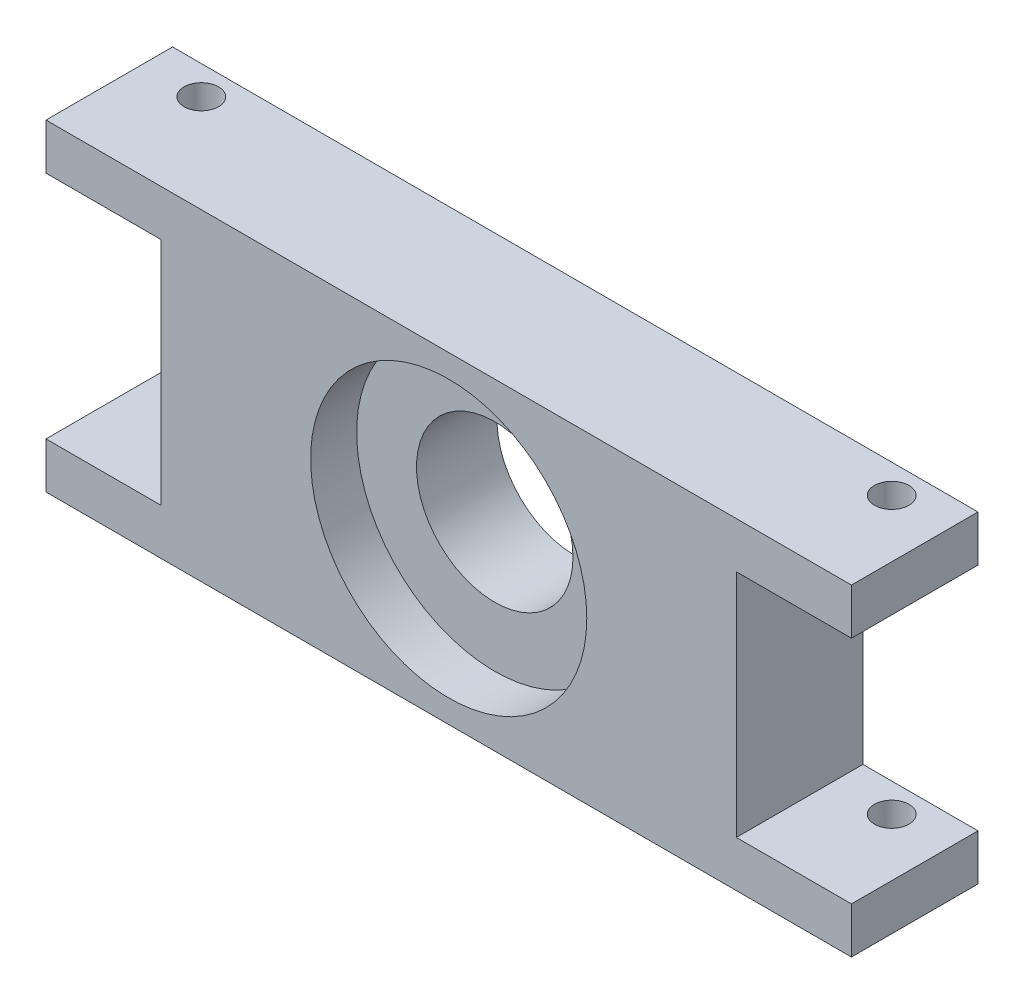
ISO-10303-21;
HEADER;
FILE_DESCRIPTION(('STEP AP214'),'2;1');
FILE_NAME('part.step','',(''),(''),'','','');
FILE_SCHEMA(('AUTOMOTIVE_DESIGN { 1 0 10303 214 1 1 1 1 }'));
ENDSEC;
DATA;
#1=APPLICATION_CONTEXT('core data for automotive mechanical design processes');
#2=APPLICATION_PROTOCOL_DEFINITION('international standard','automotive_design',2000,#1);
#3=PRODUCT_CONTEXT('',#1,'mechanical');
#4=PRODUCT('Part','Part','',(#3));
#5=PRODUCT_RELATED_PRODUCT_CATEGORY('part','',(#4));
#6=PRODUCT_DEFINITION_FORMATION('','',#4);
#7=PRODUCT_DEFINITION_CONTEXT('part definition',#1,'design');
#8=PRODUCT_DEFINITION('design','',#6,#7);
#9=PRODUCT_DEFINITION_SHAPE('','',#8);
#10=(LENGTH_UNIT() NAMED_UNIT(*) SI_UNIT(.MILLI.,.METRE.));
#11=(NAMED_UNIT(*) PLANE_ANGLE_UNIT() SI_UNIT($,.RADIAN.));
#12=(NAMED_UNIT(*) SI_UNIT($,.STERADIAN.) SOLID_ANGLE_UNIT());
#13=UNCERTAINTY_MEASURE_WITH_UNIT(LENGTH_MEASURE(1.E-05),#10,'distance_accuracy_value','');
#14=(GEOMETRIC_REPRESENTATION_CONTEXT(3) GLOBAL_UNCERTAINTY_ASSIGNED_CONTEXT((#13)) GLOBAL_UNIT_ASSIGNED_CONTEXT((#10,
#11,#12)) REPRESENTATION_CONTEXT('',''));
#15=CARTESIAN_POINT('',(0.,0.,0.));
#16=DIRECTION('',(0.,0.,1.));
#17=DIRECTION('',(1.,0.,0.));
#18=AXIS2_PLACEMENT_3D('',#15,#16,#17);
#19=CARTESIAN_POINT('',(35.,14.,11.));
#20=DIRECTION('',(-1.,0.,0.));
#21=DIRECTION('',(0.,-1.,0.));
#22=AXIS2_PLACEMENT_3D('',#19,#20,#21);
#23=PLANE('',#22);
#24=DIRECTION('',(0.,1.,0.));
#25=VECTOR('',#24,1.);
#26=CARTESIAN_POINT('',(35.,14.,11.));
#27=LINE('',#26,#25);
#28=CARTESIAN_POINT('',(35.,10.,11.));
#29=VERTEX_POINT('',#28);
#30=CARTESIAN_POINT('',(35.,14.,11.));
#31=VERTEX_POINT('',#30);
#32=EDGE_CURVE('E213',#29,#31,#27,.T.);
#33=ORIENTED_EDGE('',*,*,#32,.F.);
#34=DIRECTION('',(0.,0.,1.));
#35=VECTOR('',#34,1.);
#36=CARTESIAN_POINT('',(35.,10.,0.));
#37=LINE('',#36,#35);
#38=CARTESIAN_POINT('',(35.,10.,0.));
#39=VERTEX_POINT('',#38);
#40=EDGE_CURVE('E155',#39,#29,#37,.T.);
#41=ORIENTED_EDGE('',*,*,#40,.F.);
#42=DIRECTION('',(0.,1.,0.));
#43=VECTOR('',#42,1.);
#44=CARTESIAN_POINT('',(35.,14.,0.));
#45=LINE('',#44,#43);
#46=CARTESIAN_POINT('',(35.,14.,0.));
#47=VERTEX_POINT('',#46);
#48=EDGE_CURVE('E225',#39,#47,#45,.T.);
#49=ORIENTED_EDGE('',*,*,#48,.T.);
#50=DIRECTION('',(0.,0.,-1.));
#51=VECTOR('',#50,1.);
#52=CARTESIAN_POINT('',(35.,14.,11.));
#53=LINE('',#52,#51);
#54=EDGE_CURVE('E232',#31,#47,#53,.T.);
#55=ORIENTED_EDGE('',*,*,#54,.F.);
#56=EDGE_LOOP('',(#33,#41,#49,#55));
#57=FACE_BOUND('',#56,.T.);
#58=ADVANCED_FACE('F32',(#57),#23,.F.);
#59=CARTESIAN_POINT('',(30.,-14.,2.5));
#60=DIRECTION('',(0.,1.,0.));
#61=DIRECTION('',(0.,0.,1.));
#62=AXIS2_PLACEMENT_3D('',#59,#60,#61);
#63=CYLINDRICAL_SURFACE('',#62,1.5);
#64=CARTESIAN_POINT('',(30.,10.,2.5));
#65=DIRECTION('',(0.,1.,0.));
#66=DIRECTION('',(0.,0.,1.));
#67=AXIS2_PLACEMENT_3D('',#64,#65,#66);
#68=CIRCLE('',#67,1.5);
#69=CARTESIAN_POINT('',(30.,10.,4.));
#70=VERTEX_POINT('',#69);
#71=EDGE_CURVE('E36',#70,#70,#68,.F.);
#72=ORIENTED_EDGE('',*,*,#71,.T.);
#73=EDGE_LOOP('',(#72));
#74=FACE_BOUND('',#73,.T.);
#75=CARTESIAN_POINT('',(30.,14.,2.5));
#76=DIRECTION('',(0.,1.,0.));
#77=DIRECTION('',(0.,0.,1.));
#78=AXIS2_PLACEMENT_3D('',#75,#76,#77);
#79=CIRCLE('',#78,1.5);
#80=CARTESIAN_POINT('',(30.,14.,4.));
#81=VERTEX_POINT('',#80);
#82=EDGE_CURVE('E198',#81,#81,#79,.T.);
#83=ORIENTED_EDGE('',*,*,#82,.T.);
#84=EDGE_LOOP('',(#83));
#85=FACE_BOUND('',#84,.T.);
#86=ADVANCED_FACE('F248',(#74,#85),#63,.F.);
#87=CARTESIAN_POINT('',(-35.,14.,11.));
#88=DIRECTION('',(1.,0.,0.));
#89=DIRECTION('',(0.,1.,0.));
#90=AXIS2_PLACEMENT_3D('',#87,#88,#89);
#91=PLANE('',#90);
#92=DIRECTION('',(0.,-1.,0.));
#93=VECTOR('',#92,1.);
#94=CARTESIAN_POINT('',(-35.,14.,0.));
#95=LINE('',#94,#93);
#96=CARTESIAN_POINT('',(-35.,14.,0.));
#97=VERTEX_POINT('',#96);
#98=CARTESIAN_POINT('',(-35.,10.,0.));
#99=VERTEX_POINT('',#98);
#100=EDGE_CURVE('E220',#97,#99,#95,.T.);
#101=ORIENTED_EDGE('',*,*,#100,.T.);
#102=DIRECTION('',(0.,0.,1.));
#103=VECTOR('',#102,1.);
#104=CARTESIAN_POINT('',(-35.,10.,0.));
#105=LINE('',#104,#103);
#106=CARTESIAN_POINT('',(-35.,10.,11.));
#107=VERTEX_POINT('',#106);
#108=EDGE_CURVE('E174',#99,#107,#105,.T.);
#109=ORIENTED_EDGE('',*,*,#108,.T.);
#110=DIRECTION('',(0.,-1.,0.));
#111=VECTOR('',#110,1.);
#112=CARTESIAN_POINT('',(-35.,14.,11.));
#113=LINE('',#112,#111);
#114=CARTESIAN_POINT('',(-35.,14.,11.));
#115=VERTEX_POINT('',#114);
#116=EDGE_CURVE('E207',#115,#107,#113,.T.);
#117=ORIENTED_EDGE('',*,*,#116,.F.);
#118=DIRECTION('',(0.,0.,-1.));
#119=VECTOR('',#118,1.);
#120=CARTESIAN_POINT('',(-35.,14.,11.));
#121=LINE('',#120,#119);
#122=EDGE_CURVE('E219',#115,#97,#121,.T.);
#123=ORIENTED_EDGE('',*,*,#122,.T.);
#124=EDGE_LOOP('',(#101,#109,#117,#123));
#125=FACE_BOUND('',#124,.T.);
#126=ADVANCED_FACE('F270',(#125),#91,.F.);
#127=CARTESIAN_POINT('',(-30.,-14.,2.5));
#128=DIRECTION('',(0.,1.,0.));
#129=DIRECTION('',(0.,0.,1.));
#130=AXIS2_PLACEMENT_3D('',#127,#128,#129);
#131=CYLINDRICAL_SURFACE('',#130,1.5);
#132=CARTESIAN_POINT('',(-30.,10.,2.5));
#133=DIRECTION('',(0.,1.,0.));
#134=DIRECTION('',(0.,0.,1.));
#135=AXIS2_PLACEMENT_3D('',#132,#133,#134);
#136=CIRCLE('',#135,1.5);
#137=CARTESIAN_POINT('',(-30.,10.,4.));
#138=VERTEX_POINT('',#137);
#139=EDGE_CURVE('E190',#138,#138,#136,.F.);
#140=ORIENTED_EDGE('',*,*,#139,.T.);
#141=EDGE_LOOP('',(#140));
#142=FACE_BOUND('',#141,.T.);
#143=CARTESIAN_POINT('',(-30.,14.,2.5));
#144=DIRECTION('',(0.,1.,0.));
#145=DIRECTION('',(0.,0.,1.));
#146=AXIS2_PLACEMENT_3D('',#143,#144,#145);
#147=CIRCLE('',#146,1.5);
#148=CARTESIAN_POINT('',(-30.,14.,4.));
#149=VERTEX_POINT('',#148);
#150=EDGE_CURVE('E194',#149,#149,#147,.T.);
#151=ORIENTED_EDGE('',*,*,#150,.T.);
#152=EDGE_LOOP('',(#151));
#153=FACE_BOUND('',#152,.T.);
#154=ADVANCED_FACE('F322',(#142,#153),#131,.F.);
#155=CARTESIAN_POINT('',(0.,0.,0.));
#156=DIRECTION('',(0.,0.,1.));
#157=DIRECTION('',(1.,0.,0.));
#158=AXIS2_PLACEMENT_3D('',#155,#156,#157);
#159=CYLINDRICAL_SURFACE('',#158,6.8);
#160=CARTESIAN_POINT('',(0.,0.,0.));
#161=DIRECTION('',(0.,0.,1.));
#162=DIRECTION('',(1.,0.,0.));
#163=AXIS2_PLACEMENT_3D('',#160,#161,#162);
#164=CIRCLE('',#163,6.8);
#165=CARTESIAN_POINT('',(6.8,0.,0.));
#166=VERTEX_POINT('',#165);
#167=EDGE_CURVE('E191',#166,#166,#164,.T.);
#168=ORIENTED_EDGE('',*,*,#167,.F.);
#169=EDGE_LOOP('',(#168));
#170=FACE_BOUND('',#169,.T.);
#171=CARTESIAN_POINT('',(0.,0.,7.));
#172=DIRECTION('',(0.,0.,1.));
#173=DIRECTION('',(1.,0.,0.));
#174=AXIS2_PLACEMENT_3D('',#171,#172,#173);
#175=CIRCLE('',#174,6.8);
#176=CARTESIAN_POINT('',(6.8,0.,7.));
#177=VERTEX_POINT('',#176);
#178=EDGE_CURVE('E186',#177,#177,#175,.F.);
#179=ORIENTED_EDGE('',*,*,#178,.F.);
#180=EDGE_LOOP('',(#179));
#181=FACE_BOUND('',#180,.T.);
#182=ADVANCED_FACE('F325',(#170,#181),#159,.F.);
#183=CARTESIAN_POINT('',(-35.,-10.,11.));
#184=VERTEX_POINT('',#183);
#185=CARTESIAN_POINT('',(-35.,-14.,11.));
#186=VERTEX_POINT('',#185);
#187=EDGE_CURVE('E211',#184,#186,#113,.T.);
#188=ORIENTED_EDGE('',*,*,#187,.F.);
#189=DIRECTION('',(0.,0.,1.));
#190=VECTOR('',#189,1.);
#191=CARTESIAN_POINT('',(-35.,-10.,0.));
#192=LINE('',#191,#190);
#193=CARTESIAN_POINT('',(-35.,-10.,0.));
#194=VERTEX_POINT('',#193);
#195=EDGE_CURVE('E166',#194,#184,#192,.T.);
#196=ORIENTED_EDGE('',*,*,#195,.F.);
#197=CARTESIAN_POINT('',(-35.,-14.,0.));
#198=VERTEX_POINT('',#197);
#199=EDGE_CURVE('E204',#194,#198,#95,.T.);
#200=ORIENTED_EDGE('',*,*,#199,.T.);
#201=DIRECTION('',(0.,0.,-1.));
#202=VECTOR('',#201,1.);
#203=CARTESIAN_POINT('',(-35.,-14.,11.));
#204=LINE('',#203,#202);
#205=EDGE_CURVE('E11',#186,#198,#204,.T.);
#206=ORIENTED_EDGE('',*,*,#205,.F.);
#207=EDGE_LOOP('',(#188,#196,#200,#206));
#208=FACE_BOUND('',#207,.T.);
#209=ADVANCED_FACE('F34',(#208),#91,.F.);
#210=CARTESIAN_POINT('',(-35.,-14.,11.));
#211=DIRECTION('',(0.,1.,0.));
#212=DIRECTION('',(0.,0.,1.));
#213=AXIS2_PLACEMENT_3D('',#210,#211,#212);
#214=PLANE('',#213);
#215=CARTESIAN_POINT('',(-30.,-14.,2.5));
#216=DIRECTION('',(0.,1.,0.));
#217=DIRECTION('',(0.,0.,1.));
#218=AXIS2_PLACEMENT_3D('',#215,#216,#217);
#219=CIRCLE('',#218,1.5);
#220=CARTESIAN_POINT('',(-30.,-14.,4.));
#221=VERTEX_POINT('',#220);
#222=EDGE_CURVE('E195',#221,#221,#219,.T.);
#223=ORIENTED_EDGE('',*,*,#222,.T.);
#224=EDGE_LOOP('',(#223));
#225=FACE_BOUND('',#224,.T.);
#226=CARTESIAN_POINT('',(30.,-14.,2.5));
#227=DIRECTION('',(0.,1.,0.));
#228=DIRECTION('',(0.,0.,1.));
#229=AXIS2_PLACEMENT_3D('',#226,#227,#228);
#230=CIRCLE('',#229,1.5);
#231=CARTESIAN_POINT('',(30.,-14.,4.));
#232=VERTEX_POINT('',#231);
#233=EDGE_CURVE('E201',#232,#232,#230,.T.);
#234=ORIENTED_EDGE('',*,*,#233,.T.);
#235=EDGE_LOOP('',(#234));
#236=FACE_BOUND('',#235,.T.);
#237=DIRECTION('',(1.,0.,0.));
#238=VECTOR('',#237,1.);
#239=CARTESIAN_POINT('',(-35.,-14.,0.));
#240=LINE('',#239,#238);
#241=CARTESIAN_POINT('',(35.,-14.,0.));
#242=VERTEX_POINT('',#241);
#243=EDGE_CURVE('E223',#198,#242,#240,.T.);
#244=ORIENTED_EDGE('',*,*,#243,.T.);
#245=DIRECTION('',(0.,0.,-1.));
#246=VECTOR('',#245,1.);
#247=CARTESIAN_POINT('',(35.,-14.,11.));
#248=LINE('',#247,#246);
#249=CARTESIAN_POINT('',(35.,-14.,11.));
#250=VERTEX_POINT('',#249);
#251=EDGE_CURVE('E41',#250,#242,#248,.T.);
#252=ORIENTED_EDGE('',*,*,#251,.F.);
#253=DIRECTION('',(1.,0.,0.));
#254=VECTOR('',#253,1.);
#255=CARTESIAN_POINT('',(-35.,-14.,11.));
#256=LINE('',#255,#254);
#257=EDGE_CURVE('E210',#186,#250,#256,.T.);
#258=ORIENTED_EDGE('',*,*,#257,.F.);
#259=ORIENTED_EDGE('',*,*,#205,.T.);
#260=EDGE_LOOP('',(#244,#252,#258,#259));
#261=FACE_BOUND('',#260,.T.);
#262=ADVANCED_FACE('F277',(#225,#236,#261),#214,.F.);
#263=CARTESIAN_POINT('',(35.,-10.,0.));
#264=VERTEX_POINT('',#263);
#265=EDGE_CURVE('E226',#242,#264,#45,.T.);
#266=ORIENTED_EDGE('',*,*,#265,.T.);
#267=DIRECTION('',(0.,0.,1.));
#268=VECTOR('',#267,1.);
#269=CARTESIAN_POINT('',(35.,-10.,0.));
#270=LINE('',#269,#268);
#271=CARTESIAN_POINT('',(35.,-10.,11.));
#272=VERTEX_POINT('',#271);
#273=EDGE_CURVE('E49',#264,#272,#270,.T.);
#274=ORIENTED_EDGE('',*,*,#273,.T.);
#275=EDGE_CURVE('E214',#250,#272,#27,.T.);
#276=ORIENTED_EDGE('',*,*,#275,.F.);
#277=ORIENTED_EDGE('',*,*,#251,.T.);
#278=EDGE_LOOP('',(#266,#274,#276,#277));
#279=FACE_BOUND('',#278,.T.);
#280=ADVANCED_FACE('F266',(#279),#23,.F.);
#281=CARTESIAN_POINT('',(-35.,14.,11.));
#282=DIRECTION('',(0.,-1.,0.));
#283=DIRECTION('',(0.,0.,-1.));
#284=AXIS2_PLACEMENT_3D('',#281,#282,#283);
#285=PLANE('',#284);
#286=ORIENTED_EDGE('',*,*,#150,.F.);
#287=EDGE_LOOP('',(#286));
#288=FACE_BOUND('',#287,.T.);
#289=ORIENTED_EDGE('',*,*,#82,.F.);
#290=EDGE_LOOP('',(#289));
#291=FACE_BOUND('',#290,.T.);
#292=DIRECTION('',(-1.,0.,0.));
#293=VECTOR('',#292,1.);
#294=CARTESIAN_POINT('',(-35.,14.,0.));
#295=LINE('',#294,#293);
#296=EDGE_CURVE('E228',#47,#97,#295,.T.);
#297=ORIENTED_EDGE('',*,*,#296,.T.);
#298=ORIENTED_EDGE('',*,*,#122,.F.);
#299=DIRECTION('',(-1.,0.,0.));
#300=VECTOR('',#299,1.);
#301=CARTESIAN_POINT('',(-35.,14.,11.));
#302=LINE('',#301,#300);
#303=EDGE_CURVE('E217',#31,#115,#302,.T.);
#304=ORIENTED_EDGE('',*,*,#303,.F.);
#305=ORIENTED_EDGE('',*,*,#54,.T.);
#306=EDGE_LOOP('',(#297,#298,#304,#305));
#307=FACE_BOUND('',#306,.T.);
#308=ADVANCED_FACE('F276',(#288,#291,#307),#285,.F.);
#309=CARTESIAN_POINT('',(0.,0.,11.));
#310=DIRECTION('',(0.,0.,1.));
#311=DIRECTION('',(1.,0.,0.));
#312=AXIS2_PLACEMENT_3D('',#309,#310,#311);
#313=PLANE('',#312);
#314=DIRECTION('',(-1.,0.,0.));
#315=VECTOR('',#314,1.);
#316=CARTESIAN_POINT('',(25.,10.,11.));
#317=LINE('',#316,#315);
#318=CARTESIAN_POINT('',(25.,10.,11.));
#319=VERTEX_POINT('',#318);
#320=EDGE_CURVE('E143',#29,#319,#317,.T.);
#321=ORIENTED_EDGE('',*,*,#320,.F.);
#322=ORIENTED_EDGE('',*,*,#32,.T.);
#323=ORIENTED_EDGE('',*,*,#303,.T.);
#324=ORIENTED_EDGE('',*,*,#116,.T.);
#325=DIRECTION('',(-1.,0.,0.));
#326=VECTOR('',#325,1.);
#327=CARTESIAN_POINT('',(-35.,10.,11.));
#328=LINE('',#327,#326);
#329=CARTESIAN_POINT('',(-25.,10.,11.));
#330=VERTEX_POINT('',#329);
#331=EDGE_CURVE('E161',#330,#107,#328,.T.);
#332=ORIENTED_EDGE('',*,*,#331,.F.);
#333=DIRECTION('',(0.,1.,0.));
#334=VECTOR('',#333,1.);
#335=CARTESIAN_POINT('',(-25.,10.,11.));
#336=LINE('',#335,#334);
#337=CARTESIAN_POINT('',(-25.,-10.,11.));
#338=VERTEX_POINT('',#337);
#339=EDGE_CURVE('E170',#338,#330,#336,.T.);
#340=ORIENTED_EDGE('',*,*,#339,.F.);
#341=DIRECTION('',(1.,0.,0.));
#342=VECTOR('',#341,1.);
#343=CARTESIAN_POINT('',(-35.,-10.,11.));
#344=LINE('',#343,#342);
#345=EDGE_CURVE('E167',#184,#338,#344,.T.);
#346=ORIENTED_EDGE('',*,*,#345,.F.);
#347=ORIENTED_EDGE('',*,*,#187,.T.);
#348=ORIENTED_EDGE('',*,*,#257,.T.);
#349=ORIENTED_EDGE('',*,*,#275,.T.);
#350=DIRECTION('',(1.,0.,0.));
#351=VECTOR('',#350,1.);
#352=CARTESIAN_POINT('',(25.,-10.,11.));
#353=LINE('',#352,#351);
#354=CARTESIAN_POINT('',(25.,-10.,11.));
#355=VERTEX_POINT('',#354);
#356=EDGE_CURVE('E146',#355,#272,#353,.T.);
#357=ORIENTED_EDGE('',*,*,#356,.F.);
#358=DIRECTION('',(0.,-1.,0.));
#359=VECTOR('',#358,1.);
#360=CARTESIAN_POINT('',(25.,10.,11.));
#361=LINE('',#360,#359);
#362=EDGE_CURVE('E130',#319,#355,#361,.T.);
#363=ORIENTED_EDGE('',*,*,#362,.F.);
#364=EDGE_LOOP('',(#321,#322,#323,#324,#332,#340,#346,#347,#348,#349,#357,#363));
#365=FACE_BOUND('',#364,.T.);
#366=CARTESIAN_POINT('',(0.,0.,11.));
#367=DIRECTION('',(0.,0.,1.));
#368=DIRECTION('',(1.,0.,0.));
#369=AXIS2_PLACEMENT_3D('',#366,#367,#368);
#370=CIRCLE('',#369,12.);
#371=CARTESIAN_POINT('',(12.,0.,11.));
#372=VERTEX_POINT('',#371);
#373=EDGE_CURVE('E187',#372,#372,#370,.T.);
#374=ORIENTED_EDGE('',*,*,#373,.F.);
#375=EDGE_LOOP('',(#374));
#376=FACE_BOUND('',#375,.T.);
#377=ADVANCED_FACE('F283',(#365,#376),#313,.T.);
#378=CARTESIAN_POINT('',(0.,0.,0.));
#379=DIRECTION('',(0.,0.,1.));
#380=DIRECTION('',(1.,0.,0.));
#381=AXIS2_PLACEMENT_3D('',#378,#379,#380);
#382=PLANE('',#381);
#383=ORIENTED_EDGE('',*,*,#167,.T.);
#384=EDGE_LOOP('',(#383));
#385=FACE_BOUND('',#384,.T.);
#386=ORIENTED_EDGE('',*,*,#48,.F.);
#387=DIRECTION('',(-1.,0.,0.));
#388=VECTOR('',#387,1.);
#389=CARTESIAN_POINT('',(25.,10.,0.));
#390=LINE('',#389,#388);
#391=CARTESIAN_POINT('',(25.,10.,0.));
#392=VERTEX_POINT('',#391);
#393=EDGE_CURVE('E132',#39,#392,#390,.T.);
#394=ORIENTED_EDGE('',*,*,#393,.T.);
#395=DIRECTION('',(0.,-1.,0.));
#396=VECTOR('',#395,1.);
#397=CARTESIAN_POINT('',(25.,10.,0.));
#398=LINE('',#397,#396);
#399=CARTESIAN_POINT('',(25.,-10.,0.));
#400=VERTEX_POINT('',#399);
#401=EDGE_CURVE('E127',#392,#400,#398,.T.);
#402=ORIENTED_EDGE('',*,*,#401,.T.);
#403=DIRECTION('',(1.,0.,0.));
#404=VECTOR('',#403,1.);
#405=CARTESIAN_POINT('',(25.,-10.,0.));
#406=LINE('',#405,#404);
#407=EDGE_CURVE('E134',#400,#264,#406,.T.);
#408=ORIENTED_EDGE('',*,*,#407,.T.);
#409=ORIENTED_EDGE('',*,*,#265,.F.);
#410=ORIENTED_EDGE('',*,*,#243,.F.);
#411=ORIENTED_EDGE('',*,*,#199,.F.);
#412=DIRECTION('',(1.,0.,0.));
#413=VECTOR('',#412,1.);
#414=CARTESIAN_POINT('',(-35.,-10.,0.));
#415=LINE('',#414,#413);
#416=CARTESIAN_POINT('',(-25.,-10.,0.));
#417=VERTEX_POINT('',#416);
#418=EDGE_CURVE('E158',#194,#417,#415,.T.);
#419=ORIENTED_EDGE('',*,*,#418,.T.);
#420=DIRECTION('',(0.,1.,0.));
#421=VECTOR('',#420,1.);
#422=CARTESIAN_POINT('',(-25.,10.,0.));
#423=LINE('',#422,#421);
#424=CARTESIAN_POINT('',(-25.,10.,0.));
#425=VERTEX_POINT('',#424);
#426=EDGE_CURVE('E57',#417,#425,#423,.T.);
#427=ORIENTED_EDGE('',*,*,#426,.T.);
#428=DIRECTION('',(-1.,0.,0.));
#429=VECTOR('',#428,1.);
#430=CARTESIAN_POINT('',(-35.,10.,0.));
#431=LINE('',#430,#429);
#432=EDGE_CURVE('E163',#425,#99,#431,.T.);
#433=ORIENTED_EDGE('',*,*,#432,.T.);
#434=ORIENTED_EDGE('',*,*,#100,.F.);
#435=ORIENTED_EDGE('',*,*,#296,.F.);
#436=EDGE_LOOP('',(#386,#394,#402,#408,#409,#410,#411,#419,#427,#433,#434,#435));
#437=FACE_BOUND('',#436,.T.);
#438=ADVANCED_FACE('F142',(#385,#437),#382,.F.);
#439=CARTESIAN_POINT('',(30.,-10.,2.5));
#440=DIRECTION('',(0.,-1.,0.));
#441=DIRECTION('',(0.,0.,-1.));
#442=AXIS2_PLACEMENT_3D('',#439,#440,#441);
#443=CIRCLE('',#442,1.5);
#444=CARTESIAN_POINT('',(30.,-10.,1.));
#445=VERTEX_POINT('',#444);
#446=EDGE_CURVE('E154',#445,#445,#443,.F.);
#447=ORIENTED_EDGE('',*,*,#446,.T.);
#448=EDGE_LOOP('',(#447));
#449=FACE_BOUND('',#448,.T.);
#450=ORIENTED_EDGE('',*,*,#233,.F.);
#451=EDGE_LOOP('',(#450));
#452=FACE_BOUND('',#451,.T.);
#453=ADVANCED_FACE('F272',(#449,#452),#63,.F.);
#454=CARTESIAN_POINT('',(-30.,-10.,2.5));
#455=DIRECTION('',(0.,-1.,0.));
#456=DIRECTION('',(0.,0.,-1.));
#457=AXIS2_PLACEMENT_3D('',#454,#455,#456);
#458=CIRCLE('',#457,1.5);
#459=CARTESIAN_POINT('',(-30.,-10.,1.));
#460=VERTEX_POINT('',#459);
#461=EDGE_CURVE('E177',#460,#460,#458,.F.);
#462=ORIENTED_EDGE('',*,*,#461,.T.);
#463=EDGE_LOOP('',(#462));
#464=FACE_BOUND('',#463,.T.);
#465=ORIENTED_EDGE('',*,*,#222,.F.);
#466=EDGE_LOOP('',(#465));
#467=FACE_BOUND('',#466,.T.);
#468=ADVANCED_FACE('F327',(#464,#467),#131,.F.);
#469=CARTESIAN_POINT('',(0.,0.,7.));
#470=DIRECTION('',(0.,0.,1.));
#471=DIRECTION('',(1.,0.,0.));
#472=AXIS2_PLACEMENT_3D('',#469,#470,#471);
#473=PLANE('',#472);
#474=CARTESIAN_POINT('',(0.,0.,7.));
#475=DIRECTION('',(0.,0.,1.));
#476=DIRECTION('',(1.,0.,0.));
#477=AXIS2_PLACEMENT_3D('',#474,#475,#476);
#478=CIRCLE('',#477,12.);
#479=CARTESIAN_POINT('',(12.,0.,7.));
#480=VERTEX_POINT('',#479);
#481=EDGE_CURVE('E183',#480,#480,#478,.T.);
#482=ORIENTED_EDGE('',*,*,#481,.T.);
#483=EDGE_LOOP('',(#482));
#484=FACE_BOUND('',#483,.T.);
#485=ORIENTED_EDGE('',*,*,#178,.T.);
#486=EDGE_LOOP('',(#485));
#487=FACE_BOUND('',#486,.T.);
#488=ADVANCED_FACE('F338',(#484,#487),#473,.T.);
#489=CARTESIAN_POINT('',(0.,0.,7.));
#490=DIRECTION('',(0.,0.,1.));
#491=DIRECTION('',(1.,0.,0.));
#492=AXIS2_PLACEMENT_3D('',#489,#490,#491);
#493=CYLINDRICAL_SURFACE('',#492,12.);
#494=ORIENTED_EDGE('',*,*,#481,.F.);
#495=EDGE_LOOP('',(#494));
#496=FACE_BOUND('',#495,.T.);
#497=ORIENTED_EDGE('',*,*,#373,.T.);
#498=EDGE_LOOP('',(#497));
#499=FACE_BOUND('',#498,.T.);
#500=ADVANCED_FACE('F318',(#496,#499),#493,.F.);
#501=CARTESIAN_POINT('',(-35.,10.,0.));
#502=DIRECTION('',(0.,1.,0.));
#503=DIRECTION('',(0.,0.,1.));
#504=AXIS2_PLACEMENT_3D('',#501,#502,#503);
#505=PLANE('',#504);
#506=ORIENTED_EDGE('',*,*,#331,.T.);
#507=ORIENTED_EDGE('',*,*,#108,.F.);
#508=ORIENTED_EDGE('',*,*,#432,.F.);
#509=DIRECTION('',(0.,0.,1.));
#510=VECTOR('',#509,1.);
#511=CARTESIAN_POINT('',(-25.,10.,0.));
#512=LINE('',#511,#510);
#513=EDGE_CURVE('E178',#425,#330,#512,.T.);
#514=ORIENTED_EDGE('',*,*,#513,.T.);
#515=EDGE_LOOP('',(#506,#507,#508,#514));
#516=FACE_BOUND('',#515,.T.);
#517=ORIENTED_EDGE('',*,*,#139,.F.);
#518=EDGE_LOOP('',(#517));
#519=FACE_BOUND('',#518,.T.);
#520=ADVANCED_FACE('F315',(#516,#519),#505,.F.);
#521=CARTESIAN_POINT('',(-35.,-10.,0.));
#522=DIRECTION('',(0.,-1.,0.));
#523=DIRECTION('',(0.,0.,-1.));
#524=AXIS2_PLACEMENT_3D('',#521,#522,#523);
#525=PLANE('',#524);
#526=ORIENTED_EDGE('',*,*,#345,.T.);
#527=DIRECTION('',(0.,0.,1.));
#528=VECTOR('',#527,1.);
#529=CARTESIAN_POINT('',(-25.,-10.,0.));
#530=LINE('',#529,#528);
#531=EDGE_CURVE('E180',#417,#338,#530,.T.);
#532=ORIENTED_EDGE('',*,*,#531,.F.);
#533=ORIENTED_EDGE('',*,*,#418,.F.);
#534=ORIENTED_EDGE('',*,*,#195,.T.);
#535=EDGE_LOOP('',(#526,#532,#533,#534));
#536=FACE_BOUND('',#535,.T.);
#537=ORIENTED_EDGE('',*,*,#461,.F.);
#538=EDGE_LOOP('',(#537));
#539=FACE_BOUND('',#538,.T.);
#540=ADVANCED_FACE('F261',(#536,#539),#525,.F.);
#541=CARTESIAN_POINT('',(-25.,10.,0.));
#542=DIRECTION('',(1.,0.,0.));
#543=DIRECTION('',(0.,1.,0.));
#544=AXIS2_PLACEMENT_3D('',#541,#542,#543);
#545=PLANE('',#544);
#546=ORIENTED_EDGE('',*,*,#339,.T.);
#547=ORIENTED_EDGE('',*,*,#513,.F.);
#548=ORIENTED_EDGE('',*,*,#426,.F.);
#549=ORIENTED_EDGE('',*,*,#531,.T.);
#550=EDGE_LOOP('',(#546,#547,#548,#549));
#551=FACE_BOUND('',#550,.T.);
#552=ADVANCED_FACE('F253',(#551),#545,.F.);
#553=CARTESIAN_POINT('',(25.,10.,0.));
#554=DIRECTION('',(0.,1.,0.));
#555=DIRECTION('',(0.,0.,1.));
#556=AXIS2_PLACEMENT_3D('',#553,#554,#555);
#557=PLANE('',#556);
#558=ORIENTED_EDGE('',*,*,#320,.T.);
#559=DIRECTION('',(0.,0.,1.));
#560=VECTOR('',#559,1.);
#561=CARTESIAN_POINT('',(25.,10.,0.));
#562=LINE('',#561,#560);
#563=EDGE_CURVE('E152',#392,#319,#562,.T.);
#564=ORIENTED_EDGE('',*,*,#563,.F.);
#565=ORIENTED_EDGE('',*,*,#393,.F.);
#566=ORIENTED_EDGE('',*,*,#40,.T.);
#567=EDGE_LOOP('',(#558,#564,#565,#566));
#568=FACE_BOUND('',#567,.T.);
#569=ORIENTED_EDGE('',*,*,#71,.F.);
#570=EDGE_LOOP('',(#569));
#571=FACE_BOUND('',#570,.T.);
#572=ADVANCED_FACE('F251',(#568,#571),#557,.F.);
#573=CARTESIAN_POINT('',(25.,-10.,0.));
#574=DIRECTION('',(0.,-1.,0.));
#575=DIRECTION('',(0.,0.,-1.));
#576=AXIS2_PLACEMENT_3D('',#573,#574,#575);
#577=PLANE('',#576);
#578=ORIENTED_EDGE('',*,*,#356,.T.);
#579=ORIENTED_EDGE('',*,*,#273,.F.);
#580=ORIENTED_EDGE('',*,*,#407,.F.);
#581=DIRECTION('',(0.,0.,1.));
#582=VECTOR('',#581,1.);
#583=CARTESIAN_POINT('',(25.,-10.,0.));
#584=LINE('',#583,#582);
#585=EDGE_CURVE('E124',#400,#355,#584,.T.);
#586=ORIENTED_EDGE('',*,*,#585,.T.);
#587=EDGE_LOOP('',(#578,#579,#580,#586));
#588=FACE_BOUND('',#587,.T.);
#589=ORIENTED_EDGE('',*,*,#446,.F.);
#590=EDGE_LOOP('',(#589));
#591=FACE_BOUND('',#590,.T.);
#592=ADVANCED_FACE('F135',(#588,#591),#577,.F.);
#593=CARTESIAN_POINT('',(25.,10.,0.));
#594=DIRECTION('',(-1.,0.,0.));
#595=DIRECTION('',(0.,-1.,0.));
#596=AXIS2_PLACEMENT_3D('',#593,#594,#595);
#597=PLANE('',#596);
#598=ORIENTED_EDGE('',*,*,#362,.T.);
#599=ORIENTED_EDGE('',*,*,#585,.F.);
#600=ORIENTED_EDGE('',*,*,#401,.F.);
#601=ORIENTED_EDGE('',*,*,#563,.T.);
#602=EDGE_LOOP('',(#598,#599,#600,#601));
#603=FACE_BOUND('',#602,.T.);
#604=ADVANCED_FACE('F125',(#603),#597,.F.);
#605=CLOSED_SHELL('',(#58,#86,#126,#154,#182,#209,#262,#280,#308,#377,#438,#453,#468,#488,#500,
#520,#540,#552,#572,#592,#604));
#606=MANIFOLD_SOLID_BREP('B2',#605);
#607=ADVANCED_BREP_SHAPE_REPRESENTATION('',(#18,#606),#14);
#608=SHAPE_DEFINITION_REPRESENTATION(#9,#607);
ENDSEC;
END-ISO-10303-21;
